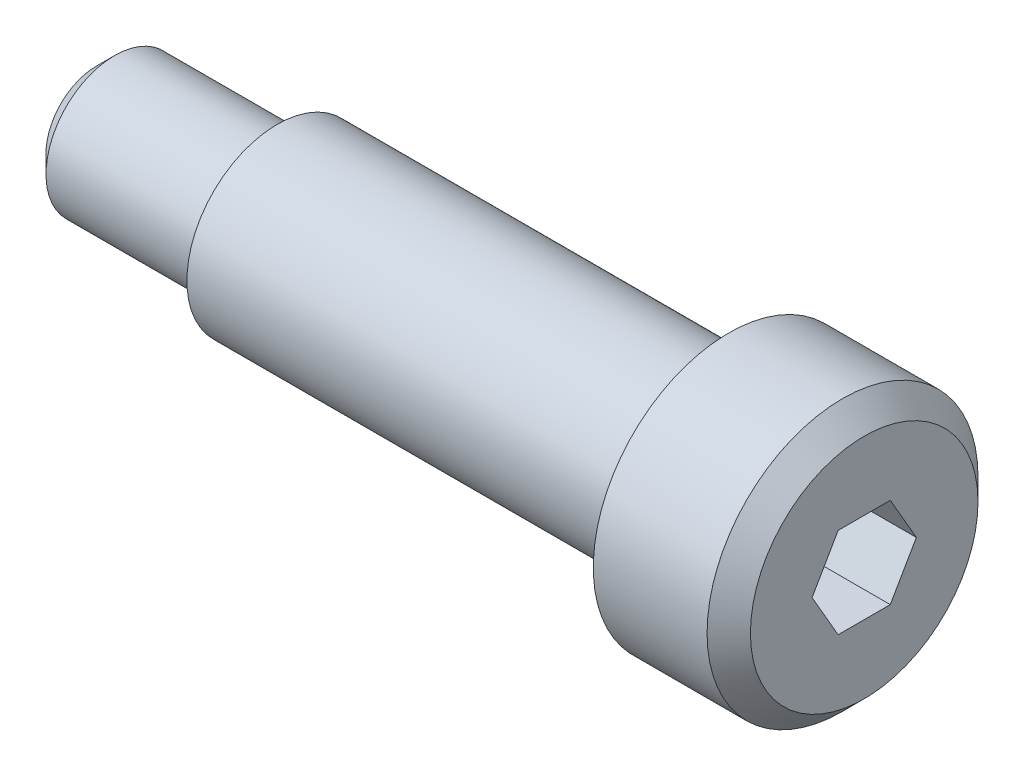
ISO-10303-21;
HEADER;
FILE_DESCRIPTION(('STEP AP214'),'2;1');
FILE_NAME('part.step','',(''),(''),'','','');
FILE_SCHEMA(('AUTOMOTIVE_DESIGN { 1 0 10303 214 1 1 1 1 }'));
ENDSEC;
DATA;
#1=APPLICATION_CONTEXT('core data for automotive mechanical design processes');
#2=APPLICATION_PROTOCOL_DEFINITION('international standard','automotive_design',2000,#1);
#3=PRODUCT_CONTEXT('',#1,'mechanical');
#4=PRODUCT('Part','Part','',(#3));
#5=PRODUCT_RELATED_PRODUCT_CATEGORY('part','',(#4));
#6=PRODUCT_DEFINITION_FORMATION('','',#4);
#7=PRODUCT_DEFINITION_CONTEXT('part definition',#1,'design');
#8=PRODUCT_DEFINITION('design','',#6,#7);
#9=PRODUCT_DEFINITION_SHAPE('','',#8);
#10=(LENGTH_UNIT() NAMED_UNIT(*) SI_UNIT(.MILLI.,.METRE.));
#11=(NAMED_UNIT(*) PLANE_ANGLE_UNIT() SI_UNIT($,.RADIAN.));
#12=(NAMED_UNIT(*) SI_UNIT($,.STERADIAN.) SOLID_ANGLE_UNIT());
#13=UNCERTAINTY_MEASURE_WITH_UNIT(LENGTH_MEASURE(1.E-05),#10,'distance_accuracy_value','');
#14=(GEOMETRIC_REPRESENTATION_CONTEXT(3) GLOBAL_UNCERTAINTY_ASSIGNED_CONTEXT((#13)) GLOBAL_UNIT_ASSIGNED_CONTEXT((#10,
#11,#12)) REPRESENTATION_CONTEXT('',''));
#15=CARTESIAN_POINT('',(0.,0.,0.));
#16=DIRECTION('',(0.,0.,1.));
#17=DIRECTION('',(1.,0.,0.));
#18=AXIS2_PLACEMENT_3D('',#15,#16,#17);
#19=CARTESIAN_POINT('',(-9.568635399,-1.5875,1.833087105));
#20=DIRECTION('',(1.,0.,0.));
#21=DIRECTION('',(0.,0.,-1.));
#22=AXIS2_PLACEMENT_3D('',#19,#20,#21);
#23=PLANE('',#22);
#24=DIRECTION('',(0.,-0.866025403628186,-0.500000000270637));
#25=VECTOR('',#24,1.);
#26=CARTESIAN_POINT('',(-9.568635399,-0.79375,1.3748153285));
#27=LINE('',#26,#25);
#28=CARTESIAN_POINT('',(-9.568635399,8.87439535919576E-10,1.83308710448764));
#29=VERTEX_POINT('',#28);
#30=CARTESIAN_POINT('',(-9.568635399,-1.5875,0.91654355225));
#31=VERTEX_POINT('',#30);
#32=EDGE_CURVE('E79',#29,#31,#27,.T.);
#33=ORIENTED_EDGE('',*,*,#32,.T.);
#34=DIRECTION('',(0.,0.,-1.));
#35=VECTOR('',#34,1.);
#36=CARTESIAN_POINT('',(-9.568635399,-1.5875,0.));
#37=LINE('',#36,#35);
#38=CARTESIAN_POINT('',(-9.568635399,-1.5875,-0.91654355225));
#39=VERTEX_POINT('',#38);
#40=EDGE_CURVE('E64',#31,#39,#37,.T.);
#41=ORIENTED_EDGE('',*,*,#40,.T.);
#42=DIRECTION('',(0.,0.866025403628186,-0.500000000270637));
#43=VECTOR('',#42,1.);
#44=CARTESIAN_POINT('',(-9.568635399,-0.79375,-1.3748153285));
#45=LINE('',#44,#43);
#46=CARTESIAN_POINT('',(-9.568635399,-8.87439535919576E-10,-1.83308710448764));
#47=VERTEX_POINT('',#46);
#48=EDGE_CURVE('E114',#39,#47,#45,.T.);
#49=ORIENTED_EDGE('',*,*,#48,.T.);
#50=DIRECTION('',(0.,0.866025403628186,0.500000000270637));
#51=VECTOR('',#50,1.);
#52=CARTESIAN_POINT('',(-9.568635399,0.79375,-1.3748153285));
#53=LINE('',#52,#51);
#54=CARTESIAN_POINT('',(-9.568635399,1.5875,-0.91654355225));
#55=VERTEX_POINT('',#54);
#56=EDGE_CURVE('E106',#47,#55,#53,.T.);
#57=ORIENTED_EDGE('',*,*,#56,.T.);
#58=DIRECTION('',(0.,0.,1.));
#59=VECTOR('',#58,1.);
#60=CARTESIAN_POINT('',(-9.568635399,1.5875,0.));
#61=LINE('',#60,#59);
#62=CARTESIAN_POINT('',(-9.568635399,1.5875,0.91654355225));
#63=VERTEX_POINT('',#62);
#64=EDGE_CURVE('E75',#55,#63,#61,.T.);
#65=ORIENTED_EDGE('',*,*,#64,.T.);
#66=DIRECTION('',(0.,-0.866025403628186,0.500000000270637));
#67=VECTOR('',#66,1.);
#68=CARTESIAN_POINT('',(-9.568635399,0.79375,1.3748153285));
#69=LINE('',#68,#67);
#70=EDGE_CURVE('E77',#63,#29,#69,.T.);
#71=ORIENTED_EDGE('',*,*,#70,.T.);
#72=EDGE_LOOP('',(#33,#41,#49,#57,#65,#71));
#73=FACE_BOUND('',#72,.T.);
#74=ADVANCED_FACE('F16',(#73),#23,.T.);
#75=CARTESIAN_POINT('',(-9.568635399,0.,1.833087105));
#76=DIRECTION('',(0.,-0.500000000270637,0.866025403628186));
#77=DIRECTION('',(0.,-0.866025403628186,-0.500000000270637));
#78=AXIS2_PLACEMENT_3D('',#75,#76,#77);
#79=PLANE('',#78);
#80=DIRECTION('',(0.,0.866025403120666,0.500000001149687));
#81=VECTOR('',#80,1.);
#82=CARTESIAN_POINT('',(-4.488635399,-1.58750000268275,0.916543548600371));
#83=LINE('',#82,#81);
#84=CARTESIAN_POINT('',(-4.488635399,-1.58750000114102,0.916543549953171));
#85=VERTEX_POINT('',#84);
#86=CARTESIAN_POINT('',(-4.488635399,3.22327169940694E-11,1.83308710520471));
#87=VERTEX_POINT('',#86);
#88=EDGE_CURVE('E20',#85,#87,#83,.T.);
#89=ORIENTED_EDGE('',*,*,#88,.F.);
#90=DIRECTION('',(-1.,0.,0.));
#91=VECTOR('',#90,1.);
#92=CARTESIAN_POINT('',(-7.028635399,-1.5875,0.916543552));
#93=LINE('',#92,#91);
#94=EDGE_CURVE('E88',#85,#31,#93,.T.);
#95=ORIENTED_EDGE('',*,*,#94,.T.);
#96=ORIENTED_EDGE('',*,*,#32,.F.);
#97=DIRECTION('',(1.,0.,0.));
#98=VECTOR('',#97,1.);
#99=CARTESIAN_POINT('',(-7.028635399,0.,1.833087105));
#100=LINE('',#99,#98);
#101=EDGE_CURVE('E84',#29,#87,#100,.T.);
#102=ORIENTED_EDGE('',*,*,#101,.T.);
#103=EDGE_LOOP('',(#89,#95,#96,#102));
#104=FACE_BOUND('',#103,.T.);
#105=ADVANCED_FACE('F86',(#104),#79,.F.);
#106=CARTESIAN_POINT('',(-9.568635399,1.5875,0.916543552));
#107=DIRECTION('',(0.,0.500000000270637,0.866025403628186));
#108=DIRECTION('',(0.,-0.866025403628186,0.500000000270637));
#109=AXIS2_PLACEMENT_3D('',#106,#107,#108);
#110=PLANE('',#109);
#111=DIRECTION('',(0.,0.866025403120666,-0.500000001149687));
#112=VECTOR('',#111,1.);
#113=CARTESIAN_POINT('',(-4.488635399,0.,1.83308710529776));
#114=LINE('',#113,#112);
#115=CARTESIAN_POINT('',(-4.488635399,1.58750000114103,0.916543549953171));
#116=VERTEX_POINT('',#115);
#117=EDGE_CURVE('E93',#87,#116,#114,.T.);
#118=ORIENTED_EDGE('',*,*,#117,.F.);
#119=ORIENTED_EDGE('',*,*,#101,.F.);
#120=ORIENTED_EDGE('',*,*,#70,.F.);
#121=DIRECTION('',(1.,0.,0.));
#122=VECTOR('',#121,1.);
#123=CARTESIAN_POINT('',(-7.028635399,1.5875,0.916543552));
#124=LINE('',#123,#122);
#125=EDGE_CURVE('E99',#63,#116,#124,.T.);
#126=ORIENTED_EDGE('',*,*,#125,.T.);
#127=EDGE_LOOP('',(#118,#119,#120,#126));
#128=FACE_BOUND('',#127,.T.);
#129=ADVANCED_FACE('F91',(#128),#110,.F.);
#130=CARTESIAN_POINT('',(-9.568635399,1.5875,-0.916543552));
#131=DIRECTION('',(0.,1.,0.));
#132=DIRECTION('',(0.,0.,1.));
#133=AXIS2_PLACEMENT_3D('',#130,#131,#132);
#134=PLANE('',#133);
#135=DIRECTION('',(0.,0.,-1.));
#136=VECTOR('',#135,1.);
#137=CARTESIAN_POINT('',(-4.488635399,1.58750000268275,0.));
#138=LINE('',#137,#136);
#139=CARTESIAN_POINT('',(-4.488635399,1.58750000114103,-0.916543549953172));
#140=VERTEX_POINT('',#139);
#141=EDGE_CURVE('E107',#116,#140,#138,.T.);
#142=ORIENTED_EDGE('',*,*,#141,.F.);
#143=ORIENTED_EDGE('',*,*,#125,.F.);
#144=ORIENTED_EDGE('',*,*,#64,.F.);
#145=DIRECTION('',(1.,0.,0.));
#146=VECTOR('',#145,1.);
#147=CARTESIAN_POINT('',(-7.028635399,1.5875,-0.916543552));
#148=LINE('',#147,#146);
#149=EDGE_CURVE('E112',#55,#140,#148,.T.);
#150=ORIENTED_EDGE('',*,*,#149,.T.);
#151=EDGE_LOOP('',(#142,#143,#144,#150));
#152=FACE_BOUND('',#151,.T.);
#153=ADVANCED_FACE('F206',(#152),#134,.F.);
#154=CARTESIAN_POINT('',(-9.568635399,0.,-1.833087105));
#155=DIRECTION('',(0.,0.500000000270637,-0.866025403628186));
#156=DIRECTION('',(0.,0.866025403628186,0.500000000270637));
#157=AXIS2_PLACEMENT_3D('',#154,#155,#156);
#158=PLANE('',#157);
#159=DIRECTION('',(0.,-0.866025403120667,-0.500000001149686));
#160=VECTOR('',#159,1.);
#161=CARTESIAN_POINT('',(-4.488635399,1.58750000268275,-0.916543548600372));
#162=LINE('',#161,#160);
#163=CARTESIAN_POINT('',(-4.488635399,3.22329740291216E-11,-1.83308710520471));
#164=VERTEX_POINT('',#163);
#165=EDGE_CURVE('E111',#140,#164,#162,.T.);
#166=ORIENTED_EDGE('',*,*,#165,.F.);
#167=ORIENTED_EDGE('',*,*,#149,.F.);
#168=ORIENTED_EDGE('',*,*,#56,.F.);
#169=DIRECTION('',(1.,0.,0.));
#170=VECTOR('',#169,1.);
#171=CARTESIAN_POINT('',(-7.028635399,0.,-1.833087105));
#172=LINE('',#171,#170);
#173=EDGE_CURVE('E152',#47,#164,#172,.T.);
#174=ORIENTED_EDGE('',*,*,#173,.T.);
#175=EDGE_LOOP('',(#166,#167,#168,#174));
#176=FACE_BOUND('',#175,.T.);
#177=ADVANCED_FACE('F170',(#176),#158,.F.);
#178=CARTESIAN_POINT('',(-9.568635399,-1.5875,-0.916543552));
#179=DIRECTION('',(0.,-0.500000000270637,-0.866025403628186));
#180=DIRECTION('',(0.,0.866025403628186,-0.500000000270637));
#181=AXIS2_PLACEMENT_3D('',#178,#179,#180);
#182=PLANE('',#181);
#183=DIRECTION('',(0.,-0.866025403120667,0.500000001149687));
#184=VECTOR('',#183,1.);
#185=CARTESIAN_POINT('',(-4.488635399,0.,-1.83308710529776));
#186=LINE('',#185,#184);
#187=CARTESIAN_POINT('',(-4.488635399,-1.58750000114102,-0.916543549953172));
#188=VERTEX_POINT('',#187);
#189=EDGE_CURVE('E137',#164,#188,#186,.T.);
#190=ORIENTED_EDGE('',*,*,#189,.F.);
#191=ORIENTED_EDGE('',*,*,#173,.F.);
#192=ORIENTED_EDGE('',*,*,#48,.F.);
#193=DIRECTION('',(1.,0.,0.));
#194=VECTOR('',#193,1.);
#195=CARTESIAN_POINT('',(-7.028635399,-1.5875,-0.916543552));
#196=LINE('',#195,#194);
#197=EDGE_CURVE('E36',#39,#188,#196,.T.);
#198=ORIENTED_EDGE('',*,*,#197,.T.);
#199=EDGE_LOOP('',(#190,#191,#192,#198));
#200=FACE_BOUND('',#199,.T.);
#201=ADVANCED_FACE('F161',(#200),#182,.F.);
#202=CARTESIAN_POINT('',(-9.568635399,-1.5875,0.916543552));
#203=DIRECTION('',(0.,-1.,0.));
#204=DIRECTION('',(0.,0.,-1.));
#205=AXIS2_PLACEMENT_3D('',#202,#203,#204);
#206=PLANE('',#205);
#207=DIRECTION('',(0.,0.,1.));
#208=VECTOR('',#207,1.);
#209=CARTESIAN_POINT('',(-4.488635399,-1.58750000268275,0.));
#210=LINE('',#209,#208);
#211=EDGE_CURVE('E136',#188,#85,#210,.T.);
#212=ORIENTED_EDGE('',*,*,#211,.F.);
#213=ORIENTED_EDGE('',*,*,#197,.F.);
#214=ORIENTED_EDGE('',*,*,#40,.F.);
#215=ORIENTED_EDGE('',*,*,#94,.F.);
#216=EDGE_LOOP('',(#212,#213,#214,#215));
#217=FACE_BOUND('',#216,.T.);
#218=ADVANCED_FACE('F159',(#217),#206,.F.);
#219=CARTESIAN_POINT('',(-4.488635399,-4.048506,4.048506));
#220=DIRECTION('',(1.,0.,0.));
#221=DIRECTION('',(0.,0.,-1.));
#222=AXIS2_PLACEMENT_3D('',#219,#220,#221);
#223=PLANE('',#222);
#224=ORIENTED_EDGE('',*,*,#189,.T.);
#225=ORIENTED_EDGE('',*,*,#211,.T.);
#226=ORIENTED_EDGE('',*,*,#88,.T.);
#227=ORIENTED_EDGE('',*,*,#117,.T.);
#228=ORIENTED_EDGE('',*,*,#141,.T.);
#229=ORIENTED_EDGE('',*,*,#165,.T.);
#230=EDGE_LOOP('',(#224,#225,#226,#227,#228,#229));
#231=FACE_BOUND('',#230,.T.);
#232=CARTESIAN_POINT('',(-4.48863539900002,0.,0.));
#233=DIRECTION('',(-1.,0.,0.));
#234=DIRECTION('',(0.,0.,1.));
#235=AXIS2_PLACEMENT_3D('',#232,#233,#234);
#236=CIRCLE('',#235,4.00050000000002);
#237=CARTESIAN_POINT('',(-4.48863539900002,0.,4.00050000000002));
#238=VERTEX_POINT('',#237);
#239=EDGE_CURVE('E132',#238,#238,#236,.F.);
#240=ORIENTED_EDGE('',*,*,#239,.T.);
#241=EDGE_LOOP('',(#240));
#242=FACE_BOUND('',#241,.T.);
#243=ADVANCED_FACE('F156',(#231,#242),#223,.T.);
#244=CARTESIAN_POINT('',(-31.476135399,-1.799336,-1.799336));
#245=DIRECTION('',(-1.,0.,0.));
#246=DIRECTION('',(0.,0.,1.));
#247=AXIS2_PLACEMENT_3D('',#244,#245,#246);
#248=PLANE('',#247);
#249=CARTESIAN_POINT('',(-31.4761354000001,0.,0.));
#250=DIRECTION('',(1.,0.,0.));
#251=DIRECTION('',(0.,1.,0.));
#252=AXIS2_PLACEMENT_3D('',#249,#250,#251);
#253=CIRCLE('',#252,1.77799999999995);
#254=CARTESIAN_POINT('',(-31.4761354000001,1.77799999999995,0.));
#255=VERTEX_POINT('',#254);
#256=EDGE_CURVE('E127',#255,#255,#253,.F.);
#257=ORIENTED_EDGE('',*,*,#256,.T.);
#258=EDGE_LOOP('',(#257));
#259=FACE_BOUND('',#258,.T.);
#260=ADVANCED_FACE('F168',(#259),#248,.T.);
#261=CARTESIAN_POINT('',(-4.488635399,0.,0.));
#262=DIRECTION('',(-1.,0.,0.));
#263=DIRECTION('',(0.,0.,1.));
#264=AXIS2_PLACEMENT_3D('',#261,#262,#263);
#265=CONICAL_SURFACE('',#264,4.0005,0.785398162741281);
#266=ORIENTED_EDGE('',*,*,#239,.F.);
#267=EDGE_LOOP('',(#266));
#268=FACE_BOUND('',#267,.T.);
#269=CARTESIAN_POINT('',(-5.250635399,0.,0.));
#270=DIRECTION('',(1.,0.,0.));
#271=DIRECTION('',(0.,1.,0.));
#272=AXIS2_PLACEMENT_3D('',#269,#270,#271);
#273=CIRCLE('',#272,4.7625);
#274=CARTESIAN_POINT('',(-5.250635399,4.7625,0.));
#275=VERTEX_POINT('',#274);
#276=EDGE_CURVE('E131',#275,#275,#273,.T.);
#277=ORIENTED_EDGE('',*,*,#276,.T.);
#278=EDGE_LOOP('',(#277));
#279=FACE_BOUND('',#278,.T.);
#280=ADVANCED_FACE('F195',(#268,#279),#265,.T.);
#281=CARTESIAN_POINT('',(-31.4761354,0.,0.));
#282=DIRECTION('',(1.,0.,0.));
#283=DIRECTION('',(0.,1.,0.));
#284=AXIS2_PLACEMENT_3D('',#281,#282,#283);
#285=CONICAL_SURFACE('',#284,1.778,0.785398161822645);
#286=ORIENTED_EDGE('',*,*,#256,.F.);
#287=EDGE_LOOP('',(#286));
#288=FACE_BOUND('',#287,.T.);
#289=CARTESIAN_POINT('',(-30.841135399,0.,0.));
#290=DIRECTION('',(1.,0.,0.));
#291=DIRECTION('',(0.,1.,0.));
#292=AXIS2_PLACEMENT_3D('',#289,#290,#291);
#293=CIRCLE('',#292,2.413);
#294=CARTESIAN_POINT('',(-30.841135399,2.413,0.));
#295=VERTEX_POINT('',#294);
#296=EDGE_CURVE('E126',#295,#295,#293,.F.);
#297=ORIENTED_EDGE('',*,*,#296,.T.);
#298=EDGE_LOOP('',(#297));
#299=FACE_BOUND('',#298,.T.);
#300=ADVANCED_FACE('F191',(#288,#299),#285,.T.);
#301=CARTESIAN_POINT('',(-9.251135399,0.,0.));
#302=DIRECTION('',(1.,0.,0.));
#303=DIRECTION('',(0.,0.,-1.));
#304=AXIS2_PLACEMENT_3D('',#301,#302,#303);
#305=CYLINDRICAL_SURFACE('',#304,4.7625);
#306=ORIENTED_EDGE('',*,*,#276,.F.);
#307=EDGE_LOOP('',(#306));
#308=FACE_BOUND('',#307,.T.);
#309=CARTESIAN_POINT('',(-9.251135399,0.,0.));
#310=DIRECTION('',(1.,0.,0.));
#311=DIRECTION('',(0.,0.,-1.));
#312=AXIS2_PLACEMENT_3D('',#309,#310,#311);
#313=CIRCLE('',#312,4.7625);
#314=CARTESIAN_POINT('',(-9.251135399,0.,-4.7625));
#315=VERTEX_POINT('',#314);
#316=EDGE_CURVE('E123',#315,#315,#313,.F.);
#317=ORIENTED_EDGE('',*,*,#316,.F.);
#318=EDGE_LOOP('',(#317));
#319=FACE_BOUND('',#318,.T.);
#320=ADVANCED_FACE('F187',(#308,#319),#305,.T.);
#321=CARTESIAN_POINT('',(-30.841135399,0.,0.));
#322=DIRECTION('',(1.,0.,0.));
#323=DIRECTION('',(0.,0.,-1.));
#324=AXIS2_PLACEMENT_3D('',#321,#322,#323);
#325=CYLINDRICAL_SURFACE('',#324,2.413);
#326=ORIENTED_EDGE('',*,*,#296,.F.);
#327=EDGE_LOOP('',(#326));
#328=FACE_BOUND('',#327,.T.);
#329=CARTESIAN_POINT('',(-25.126135399,0.,0.));
#330=DIRECTION('',(1.,0.,0.));
#331=DIRECTION('',(0.,0.,-1.));
#332=AXIS2_PLACEMENT_3D('',#329,#330,#331);
#333=CIRCLE('',#332,2.413);
#334=CARTESIAN_POINT('',(-25.126135399,0.,-2.413));
#335=VERTEX_POINT('',#334);
#336=EDGE_CURVE('E119',#335,#335,#333,.T.);
#337=ORIENTED_EDGE('',*,*,#336,.F.);
#338=EDGE_LOOP('',(#337));
#339=FACE_BOUND('',#338,.T.);
#340=ADVANCED_FACE('F184',(#328,#339),#325,.T.);
#341=CARTESIAN_POINT('',(-9.251135399,-4.81965,-4.81965));
#342=DIRECTION('',(-1.,0.,0.));
#343=DIRECTION('',(0.,0.,1.));
#344=AXIS2_PLACEMENT_3D('',#341,#342,#343);
#345=PLANE('',#344);
#346=CARTESIAN_POINT('',(-9.251135399,0.,0.));
#347=DIRECTION('',(1.,0.,0.));
#348=DIRECTION('',(0.,0.,-1.));
#349=AXIS2_PLACEMENT_3D('',#346,#347,#348);
#350=CIRCLE('',#349,3.175);
#351=CARTESIAN_POINT('',(-9.251135399,0.,-3.17500000000001));
#352=VERTEX_POINT('',#351);
#353=EDGE_CURVE('E27',#352,#352,#350,.T.);
#354=ORIENTED_EDGE('',*,*,#353,.T.);
#355=EDGE_LOOP('',(#354));
#356=FACE_BOUND('',#355,.T.);
#357=ORIENTED_EDGE('',*,*,#316,.T.);
#358=EDGE_LOOP('',(#357));
#359=FACE_BOUND('',#358,.T.);
#360=ADVANCED_FACE('F179',(#356,#359),#345,.T.);
#361=CARTESIAN_POINT('',(-25.126135399,-3.2131,-3.2131));
#362=DIRECTION('',(-1.,0.,0.));
#363=DIRECTION('',(0.,0.,1.));
#364=AXIS2_PLACEMENT_3D('',#361,#362,#363);
#365=PLANE('',#364);
#366=ORIENTED_EDGE('',*,*,#336,.T.);
#367=EDGE_LOOP('',(#366));
#368=FACE_BOUND('',#367,.T.);
#369=CARTESIAN_POINT('',(-25.126135399,0.,0.));
#370=DIRECTION('',(1.,0.,0.));
#371=DIRECTION('',(0.,0.,-1.));
#372=AXIS2_PLACEMENT_3D('',#369,#370,#371);
#373=CIRCLE('',#372,3.175);
#374=CARTESIAN_POINT('',(-25.126135399,0.,-3.175));
#375=VERTEX_POINT('',#374);
#376=EDGE_CURVE('E11',#375,#375,#373,.F.);
#377=ORIENTED_EDGE('',*,*,#376,.T.);
#378=EDGE_LOOP('',(#377));
#379=FACE_BOUND('',#378,.T.);
#380=ADVANCED_FACE('F18',(#368,#379),#365,.T.);
#381=CARTESIAN_POINT('',(-25.126135399,0.,0.));
#382=DIRECTION('',(1.,0.,0.));
#383=DIRECTION('',(0.,0.,-1.));
#384=AXIS2_PLACEMENT_3D('',#381,#382,#383);
#385=CYLINDRICAL_SURFACE('',#384,3.175);
#386=ORIENTED_EDGE('',*,*,#353,.F.);
#387=EDGE_LOOP('',(#386));
#388=FACE_BOUND('',#387,.T.);
#389=ORIENTED_EDGE('',*,*,#376,.F.);
#390=EDGE_LOOP('',(#389));
#391=FACE_BOUND('',#390,.T.);
#392=ADVANCED_FACE('F172',(#388,#391),#385,.T.);
#393=CLOSED_SHELL('',(#74,#105,#129,#153,#177,#201,#218,#243,#260,#280,#300,#320,#340,#360,#380,#392));
#394=MANIFOLD_SOLID_BREP('B1',#393);
#395=ADVANCED_BREP_SHAPE_REPRESENTATION('',(#18,#394),#14);
#396=SHAPE_DEFINITION_REPRESENTATION(#9,#395);
ENDSEC;
END-ISO-10303-21;
